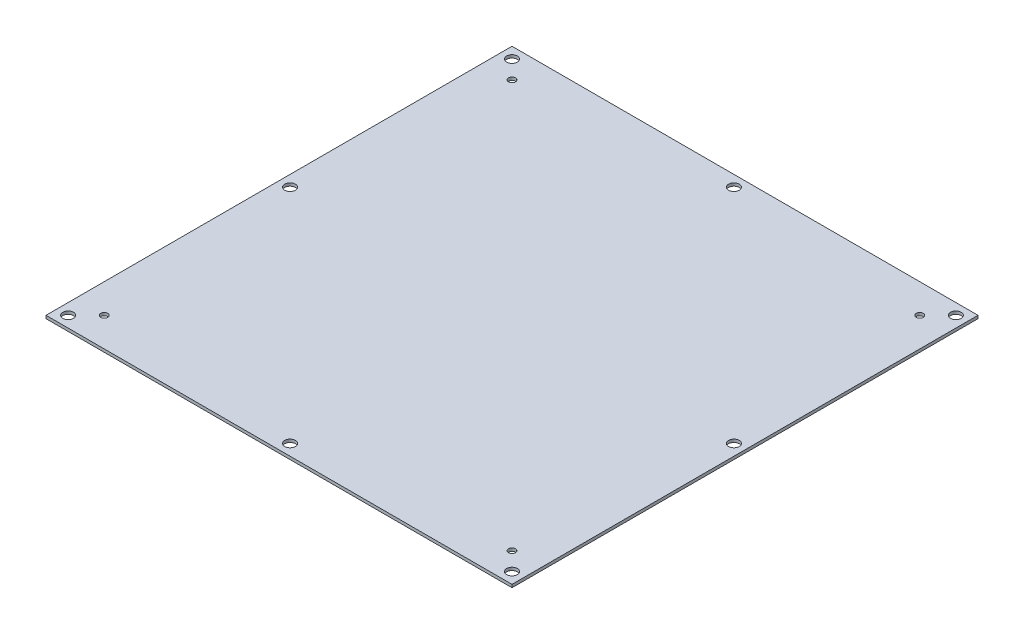
ISO-10303-21;
HEADER;
FILE_DESCRIPTION(('STEP AP214'),'2;1');
FILE_NAME('part.step','',(''),(''),'','','');
FILE_SCHEMA(('AUTOMOTIVE_DESIGN { 1 0 10303 214 1 1 1 1 }'));
ENDSEC;
DATA;
#1=APPLICATION_CONTEXT('core data for automotive mechanical design processes');
#2=APPLICATION_PROTOCOL_DEFINITION('international standard','automotive_design',2000,#1);
#3=PRODUCT_CONTEXT('',#1,'mechanical');
#4=PRODUCT('Part','Part','',(#3));
#5=PRODUCT_RELATED_PRODUCT_CATEGORY('part','',(#4));
#6=PRODUCT_DEFINITION_FORMATION('','',#4);
#7=PRODUCT_DEFINITION_CONTEXT('part definition',#1,'design');
#8=PRODUCT_DEFINITION('design','',#6,#7);
#9=PRODUCT_DEFINITION_SHAPE('','',#8);
#10=(LENGTH_UNIT() NAMED_UNIT(*) SI_UNIT(.MILLI.,.METRE.));
#11=(NAMED_UNIT(*) PLANE_ANGLE_UNIT() SI_UNIT($,.RADIAN.));
#12=(NAMED_UNIT(*) SI_UNIT($,.STERADIAN.) SOLID_ANGLE_UNIT());
#13=UNCERTAINTY_MEASURE_WITH_UNIT(LENGTH_MEASURE(1.E-05),#10,'distance_accuracy_value','');
#14=(GEOMETRIC_REPRESENTATION_CONTEXT(3) GLOBAL_UNCERTAINTY_ASSIGNED_CONTEXT((#13)) GLOBAL_UNIT_ASSIGNED_CONTEXT((#10,
#11,#12)) REPRESENTATION_CONTEXT('',''));
#15=CARTESIAN_POINT('',(0.,0.,0.));
#16=DIRECTION('',(0.,0.,1.));
#17=DIRECTION('',(1.,0.,0.));
#18=AXIS2_PLACEMENT_3D('',#15,#16,#17);
#19=CARTESIAN_POINT('',(0.,0.,0.));
#20=DIRECTION('',(0.,-1.,0.));
#21=DIRECTION('',(0.,0.,-1.));
#22=AXIS2_PLACEMENT_3D('',#19,#20,#21);
#23=PLANE('',#22);
#24=CARTESIAN_POINT('',(-114.3,0.,-114.3));
#25=DIRECTION('',(0.,1.,0.));
#26=DIRECTION('',(0.,0.,1.));
#27=AXIS2_PLACEMENT_3D('',#24,#25,#26);
#28=CIRCLE('',#27,2.75);
#29=CARTESIAN_POINT('',(-114.3,0.,-111.55));
#30=VERTEX_POINT('',#29);
#31=EDGE_CURVE('E475',#30,#30,#28,.T.);
#32=ORIENTED_EDGE('',*,*,#31,.F.);
#33=EDGE_LOOP('',(#32));
#34=FACE_BOUND('',#33,.T.);
#35=CARTESIAN_POINT('',(114.3,0.,-114.3));
#36=DIRECTION('',(0.,1.,0.));
#37=DIRECTION('',(0.,0.,1.));
#38=AXIS2_PLACEMENT_3D('',#35,#36,#37);
#39=CIRCLE('',#38,2.75);
#40=CARTESIAN_POINT('',(114.3,0.,-111.55));
#41=VERTEX_POINT('',#40);
#42=EDGE_CURVE('E270',#41,#41,#39,.T.);
#43=ORIENTED_EDGE('',*,*,#42,.F.);
#44=EDGE_LOOP('',(#43));
#45=FACE_BOUND('',#44,.T.);
#46=CARTESIAN_POINT('',(-114.3,0.,114.3));
#47=DIRECTION('',(0.,1.,0.));
#48=DIRECTION('',(0.,0.,1.));
#49=AXIS2_PLACEMENT_3D('',#46,#47,#48);
#50=CIRCLE('',#49,2.75);
#51=CARTESIAN_POINT('',(-114.3,0.,117.05));
#52=VERTEX_POINT('',#51);
#53=EDGE_CURVE('E267',#52,#52,#50,.T.);
#54=ORIENTED_EDGE('',*,*,#53,.F.);
#55=EDGE_LOOP('',(#54));
#56=FACE_BOUND('',#55,.T.);
#57=CARTESIAN_POINT('',(114.3,0.,0.));
#58=DIRECTION('',(0.,1.,0.));
#59=DIRECTION('',(0.,0.,1.));
#60=AXIS2_PLACEMENT_3D('',#57,#58,#59);
#61=CIRCLE('',#60,2.75);
#62=CARTESIAN_POINT('',(114.3,0.,2.75000000000003));
#63=VERTEX_POINT('',#62);
#64=EDGE_CURVE('E287',#63,#63,#61,.T.);
#65=ORIENTED_EDGE('',*,*,#64,.F.);
#66=EDGE_LOOP('',(#65));
#67=FACE_BOUND('',#66,.T.);
#68=CARTESIAN_POINT('',(0.,0.,114.3));
#69=DIRECTION('',(0.,1.,0.));
#70=DIRECTION('',(0.,0.,1.));
#71=AXIS2_PLACEMENT_3D('',#68,#69,#70);
#72=CIRCLE('',#71,2.75);
#73=CARTESIAN_POINT('',(0.,0.,117.05));
#74=VERTEX_POINT('',#73);
#75=EDGE_CURVE('E212',#74,#74,#72,.T.);
#76=ORIENTED_EDGE('',*,*,#75,.F.);
#77=EDGE_LOOP('',(#76));
#78=FACE_BOUND('',#77,.T.);
#79=CARTESIAN_POINT('',(-105.,0.,-105.));
#80=DIRECTION('',(0.,1.,0.));
#81=DIRECTION('',(0.,0.,1.));
#82=AXIS2_PLACEMENT_3D('',#79,#80,#81);
#83=CIRCLE('',#82,1.79999999999998);
#84=CARTESIAN_POINT('',(-105.,0.,-103.2));
#85=VERTEX_POINT('',#84);
#86=EDGE_CURVE('E224',#85,#85,#83,.T.);
#87=ORIENTED_EDGE('',*,*,#86,.F.);
#88=EDGE_LOOP('',(#87));
#89=FACE_BOUND('',#88,.T.);
#90=CARTESIAN_POINT('',(105.,0.,-105.));
#91=DIRECTION('',(0.,1.,0.));
#92=DIRECTION('',(0.,0.,1.));
#93=AXIS2_PLACEMENT_3D('',#90,#91,#92);
#94=CIRCLE('',#93,1.79999999999998);
#95=CARTESIAN_POINT('',(105.,0.,-103.2));
#96=VERTEX_POINT('',#95);
#97=EDGE_CURVE('E230',#96,#96,#94,.T.);
#98=ORIENTED_EDGE('',*,*,#97,.F.);
#99=EDGE_LOOP('',(#98));
#100=FACE_BOUND('',#99,.T.);
#101=CARTESIAN_POINT('',(105.,0.,105.));
#102=DIRECTION('',(0.,1.,0.));
#103=DIRECTION('',(0.,0.,1.));
#104=AXIS2_PLACEMENT_3D('',#101,#102,#103);
#105=CIRCLE('',#104,1.79999999999998);
#106=CARTESIAN_POINT('',(105.,0.,106.8));
#107=VERTEX_POINT('',#106);
#108=EDGE_CURVE('E236',#107,#107,#105,.T.);
#109=ORIENTED_EDGE('',*,*,#108,.F.);
#110=EDGE_LOOP('',(#109));
#111=FACE_BOUND('',#110,.T.);
#112=CARTESIAN_POINT('',(-105.,0.,105.));
#113=DIRECTION('',(0.,1.,0.));
#114=DIRECTION('',(0.,0.,1.));
#115=AXIS2_PLACEMENT_3D('',#112,#113,#114);
#116=CIRCLE('',#115,1.79999999999998);
#117=CARTESIAN_POINT('',(-105.,0.,106.8));
#118=VERTEX_POINT('',#117);
#119=EDGE_CURVE('E156',#118,#118,#116,.T.);
#120=ORIENTED_EDGE('',*,*,#119,.F.);
#121=EDGE_LOOP('',(#120));
#122=FACE_BOUND('',#121,.T.);
#123=DIRECTION('',(1.,0.,0.));
#124=VECTOR('',#123,1.);
#125=CARTESIAN_POINT('',(0.,0.,-120.));
#126=LINE('',#125,#124);
#127=CARTESIAN_POINT('',(-120.,0.,-120.));
#128=VERTEX_POINT('',#127);
#129=CARTESIAN_POINT('',(120.,0.,-120.));
#130=VERTEX_POINT('',#129);
#131=EDGE_CURVE('E220',#128,#130,#126,.T.);
#132=ORIENTED_EDGE('',*,*,#131,.F.);
#133=DIRECTION('',(0.,0.,-1.));
#134=VECTOR('',#133,1.);
#135=CARTESIAN_POINT('',(-120.,0.,0.));
#136=LINE('',#135,#134);
#137=CARTESIAN_POINT('',(-120.,0.,120.));
#138=VERTEX_POINT('',#137);
#139=EDGE_CURVE('E203',#138,#128,#136,.T.);
#140=ORIENTED_EDGE('',*,*,#139,.F.);
#141=DIRECTION('',(1.,0.,0.));
#142=VECTOR('',#141,1.);
#143=CARTESIAN_POINT('',(0.,0.,120.));
#144=LINE('',#143,#142);
#145=CARTESIAN_POINT('',(120.,0.,120.));
#146=VERTEX_POINT('',#145);
#147=EDGE_CURVE('E168',#138,#146,#144,.T.);
#148=ORIENTED_EDGE('',*,*,#147,.T.);
#149=DIRECTION('',(0.,0.,-1.));
#150=VECTOR('',#149,1.);
#151=CARTESIAN_POINT('',(120.,0.,0.));
#152=LINE('',#151,#150);
#153=EDGE_CURVE('E202',#146,#130,#152,.T.);
#154=ORIENTED_EDGE('',*,*,#153,.T.);
#155=EDGE_LOOP('',(#132,#140,#148,#154));
#156=FACE_BOUND('',#155,.T.);
#157=CARTESIAN_POINT('',(0.,0.,-114.3));
#158=DIRECTION('',(0.,1.,0.));
#159=DIRECTION('',(0.,0.,1.));
#160=AXIS2_PLACEMENT_3D('',#157,#158,#159);
#161=CIRCLE('',#160,2.75);
#162=CARTESIAN_POINT('',(0.,0.,-111.55));
#163=VERTEX_POINT('',#162);
#164=EDGE_CURVE('E254',#163,#163,#161,.T.);
#165=ORIENTED_EDGE('',*,*,#164,.F.);
#166=EDGE_LOOP('',(#165));
#167=FACE_BOUND('',#166,.T.);
#168=CARTESIAN_POINT('',(-114.3,0.,0.));
#169=DIRECTION('',(0.,1.,0.));
#170=DIRECTION('',(0.,0.,1.));
#171=AXIS2_PLACEMENT_3D('',#168,#169,#170);
#172=CIRCLE('',#171,2.75);
#173=CARTESIAN_POINT('',(-114.3,0.,2.74999999999999));
#174=VERTEX_POINT('',#173);
#175=EDGE_CURVE('E258',#174,#174,#172,.T.);
#176=ORIENTED_EDGE('',*,*,#175,.F.);
#177=EDGE_LOOP('',(#176));
#178=FACE_BOUND('',#177,.T.);
#179=CARTESIAN_POINT('',(114.3,0.,114.3));
#180=DIRECTION('',(0.,1.,0.));
#181=DIRECTION('',(0.,0.,1.));
#182=AXIS2_PLACEMENT_3D('',#179,#180,#181);
#183=CIRCLE('',#182,2.75);
#184=CARTESIAN_POINT('',(114.3,0.,117.05));
#185=VERTEX_POINT('',#184);
#186=EDGE_CURVE('E261',#185,#185,#183,.T.);
#187=ORIENTED_EDGE('',*,*,#186,.F.);
#188=EDGE_LOOP('',(#187));
#189=FACE_BOUND('',#188,.T.);
#190=ADVANCED_FACE('F149',(#34,#45,#56,#67,#78,#89,#100,#111,#122,#156,#167,#178,#189),#23,.F.);
#191=CARTESIAN_POINT('',(0.,-1.51892,0.));
#192=DIRECTION('',(0.,-1.,0.));
#193=DIRECTION('',(0.,0.,-1.));
#194=AXIS2_PLACEMENT_3D('',#191,#192,#193);
#195=PLANE('',#194);
#196=CARTESIAN_POINT('',(-114.3,-1.51892,-114.3));
#197=DIRECTION('',(0.,-1.,0.));
#198=DIRECTION('',(0.,0.,-1.));
#199=AXIS2_PLACEMENT_3D('',#196,#197,#198);
#200=CIRCLE('',#199,2.75);
#201=CARTESIAN_POINT('',(-114.3,-1.51892,-117.05));
#202=VERTEX_POINT('',#201);
#203=EDGE_CURVE('E331',#202,#202,#200,.T.);
#204=ORIENTED_EDGE('',*,*,#203,.F.);
#205=EDGE_LOOP('',(#204));
#206=FACE_BOUND('',#205,.T.);
#207=CARTESIAN_POINT('',(114.3,-1.51892,-114.3));
#208=DIRECTION('',(0.,-1.,0.));
#209=DIRECTION('',(0.,0.,-1.));
#210=AXIS2_PLACEMENT_3D('',#207,#208,#209);
#211=CIRCLE('',#210,2.75);
#212=CARTESIAN_POINT('',(114.3,-1.51892,-117.05));
#213=VERTEX_POINT('',#212);
#214=EDGE_CURVE('E264',#213,#213,#211,.T.);
#215=ORIENTED_EDGE('',*,*,#214,.F.);
#216=EDGE_LOOP('',(#215));
#217=FACE_BOUND('',#216,.T.);
#218=CARTESIAN_POINT('',(114.3,-1.51892,114.3));
#219=DIRECTION('',(0.,-1.,0.));
#220=DIRECTION('',(0.,0.,-1.));
#221=AXIS2_PLACEMENT_3D('',#218,#219,#220);
#222=CIRCLE('',#221,2.75);
#223=CARTESIAN_POINT('',(114.3,-1.51892,111.55));
#224=VERTEX_POINT('',#223);
#225=EDGE_CURVE('E263',#224,#224,#222,.T.);
#226=ORIENTED_EDGE('',*,*,#225,.F.);
#227=EDGE_LOOP('',(#226));
#228=FACE_BOUND('',#227,.T.);
#229=CARTESIAN_POINT('',(-114.3,-1.51892,114.3));
#230=DIRECTION('',(0.,-1.,0.));
#231=DIRECTION('',(0.,0.,-1.));
#232=AXIS2_PLACEMENT_3D('',#229,#230,#231);
#233=CIRCLE('',#232,2.75);
#234=CARTESIAN_POINT('',(-114.3,-1.51892,111.55));
#235=VERTEX_POINT('',#234);
#236=EDGE_CURVE('E276',#235,#235,#233,.T.);
#237=ORIENTED_EDGE('',*,*,#236,.F.);
#238=EDGE_LOOP('',(#237));
#239=FACE_BOUND('',#238,.T.);
#240=CARTESIAN_POINT('',(-114.3,-1.51892,0.));
#241=DIRECTION('',(0.,-1.,0.));
#242=DIRECTION('',(0.,0.,-1.));
#243=AXIS2_PLACEMENT_3D('',#240,#241,#242);
#244=CIRCLE('',#243,2.75);
#245=CARTESIAN_POINT('',(-114.3,-1.51892,-2.75000000000002));
#246=VERTEX_POINT('',#245);
#247=EDGE_CURVE('E280',#246,#246,#244,.T.);
#248=ORIENTED_EDGE('',*,*,#247,.F.);
#249=EDGE_LOOP('',(#248));
#250=FACE_BOUND('',#249,.T.);
#251=CARTESIAN_POINT('',(0.,-1.51892,-114.3));
#252=DIRECTION('',(0.,-1.,0.));
#253=DIRECTION('',(0.,0.,-1.));
#254=AXIS2_PLACEMENT_3D('',#251,#252,#253);
#255=CIRCLE('',#254,2.75);
#256=CARTESIAN_POINT('',(0.,-1.51892,-117.05));
#257=VERTEX_POINT('',#256);
#258=EDGE_CURVE('E284',#257,#257,#255,.T.);
#259=ORIENTED_EDGE('',*,*,#258,.F.);
#260=EDGE_LOOP('',(#259));
#261=FACE_BOUND('',#260,.T.);
#262=CARTESIAN_POINT('',(114.3,-1.51892,0.));
#263=DIRECTION('',(0.,-1.,0.));
#264=DIRECTION('',(0.,0.,-1.));
#265=AXIS2_PLACEMENT_3D('',#262,#263,#264);
#266=CIRCLE('',#265,2.75);
#267=CARTESIAN_POINT('',(114.3,-1.51892,-2.74999999999997));
#268=VERTEX_POINT('',#267);
#269=EDGE_CURVE('E290',#268,#268,#266,.T.);
#270=ORIENTED_EDGE('',*,*,#269,.F.);
#271=EDGE_LOOP('',(#270));
#272=FACE_BOUND('',#271,.T.);
#273=CARTESIAN_POINT('',(0.,-1.51892,114.3));
#274=DIRECTION('',(0.,-1.,0.));
#275=DIRECTION('',(0.,0.,-1.));
#276=AXIS2_PLACEMENT_3D('',#273,#274,#275);
#277=CIRCLE('',#276,2.75);
#278=CARTESIAN_POINT('',(0.,-1.51892,111.55));
#279=VERTEX_POINT('',#278);
#280=EDGE_CURVE('E207',#279,#279,#277,.T.);
#281=ORIENTED_EDGE('',*,*,#280,.F.);
#282=EDGE_LOOP('',(#281));
#283=FACE_BOUND('',#282,.T.);
#284=CARTESIAN_POINT('',(-105.,-1.51892,-105.));
#285=DIRECTION('',(0.,1.,0.));
#286=DIRECTION('',(0.,0.,1.));
#287=AXIS2_PLACEMENT_3D('',#284,#285,#286);
#288=CIRCLE('',#287,1.8);
#289=CARTESIAN_POINT('',(-105.,-1.51892,-103.2));
#290=VERTEX_POINT('',#289);
#291=EDGE_CURVE('E227',#290,#290,#288,.T.);
#292=ORIENTED_EDGE('',*,*,#291,.T.);
#293=EDGE_LOOP('',(#292));
#294=FACE_BOUND('',#293,.T.);
#295=CARTESIAN_POINT('',(105.,-1.51892,-105.));
#296=DIRECTION('',(0.,1.,0.));
#297=DIRECTION('',(0.,0.,1.));
#298=AXIS2_PLACEMENT_3D('',#295,#296,#297);
#299=CIRCLE('',#298,1.8);
#300=CARTESIAN_POINT('',(105.,-1.51892,-103.2));
#301=VERTEX_POINT('',#300);
#302=EDGE_CURVE('E233',#301,#301,#299,.T.);
#303=ORIENTED_EDGE('',*,*,#302,.T.);
#304=EDGE_LOOP('',(#303));
#305=FACE_BOUND('',#304,.T.);
#306=CARTESIAN_POINT('',(105.,-1.51892,105.));
#307=DIRECTION('',(0.,1.,0.));
#308=DIRECTION('',(0.,0.,1.));
#309=AXIS2_PLACEMENT_3D('',#306,#307,#308);
#310=CIRCLE('',#309,1.8);
#311=CARTESIAN_POINT('',(105.,-1.51892,106.8));
#312=VERTEX_POINT('',#311);
#313=EDGE_CURVE('E239',#312,#312,#310,.T.);
#314=ORIENTED_EDGE('',*,*,#313,.T.);
#315=EDGE_LOOP('',(#314));
#316=FACE_BOUND('',#315,.T.);
#317=CARTESIAN_POINT('',(-105.,-1.51892,105.));
#318=DIRECTION('',(0.,1.,0.));
#319=DIRECTION('',(0.,0.,1.));
#320=AXIS2_PLACEMENT_3D('',#317,#318,#319);
#321=CIRCLE('',#320,1.8);
#322=CARTESIAN_POINT('',(-105.,-1.51892,106.8));
#323=VERTEX_POINT('',#322);
#324=EDGE_CURVE('E13',#323,#323,#321,.T.);
#325=ORIENTED_EDGE('',*,*,#324,.T.);
#326=EDGE_LOOP('',(#325));
#327=FACE_BOUND('',#326,.T.);
#328=DIRECTION('',(0.,0.,-1.));
#329=VECTOR('',#328,1.);
#330=CARTESIAN_POINT('',(-120.,-1.51892,0.));
#331=LINE('',#330,#329);
#332=CARTESIAN_POINT('',(-120.,-1.51892,120.));
#333=VERTEX_POINT('',#332);
#334=CARTESIAN_POINT('',(-120.,-1.51892,-120.));
#335=VERTEX_POINT('',#334);
#336=EDGE_CURVE('E188',#333,#335,#331,.T.);
#337=ORIENTED_EDGE('',*,*,#336,.T.);
#338=DIRECTION('',(1.,0.,0.));
#339=VECTOR('',#338,1.);
#340=CARTESIAN_POINT('',(0.,-1.51892,-120.));
#341=LINE('',#340,#339);
#342=CARTESIAN_POINT('',(120.,-1.51892,-120.));
#343=VERTEX_POINT('',#342);
#344=EDGE_CURVE('E193',#335,#343,#341,.T.);
#345=ORIENTED_EDGE('',*,*,#344,.T.);
#346=DIRECTION('',(0.,0.,-1.));
#347=VECTOR('',#346,1.);
#348=CARTESIAN_POINT('',(120.,-1.51892,0.));
#349=LINE('',#348,#347);
#350=CARTESIAN_POINT('',(120.,-1.51892,120.));
#351=VERTEX_POINT('',#350);
#352=EDGE_CURVE('E191',#351,#343,#349,.T.);
#353=ORIENTED_EDGE('',*,*,#352,.F.);
#354=DIRECTION('',(1.,0.,0.));
#355=VECTOR('',#354,1.);
#356=CARTESIAN_POINT('',(0.,-1.51892,120.));
#357=LINE('',#356,#355);
#358=EDGE_CURVE('E163',#333,#351,#357,.T.);
#359=ORIENTED_EDGE('',*,*,#358,.F.);
#360=EDGE_LOOP('',(#337,#345,#353,#359));
#361=FACE_BOUND('',#360,.T.);
#362=ADVANCED_FACE('F187',(#206,#217,#228,#239,#250,#261,#272,#283,#294,#305,#316,#327,#361),
#195,.T.);
#363=CARTESIAN_POINT('',(-105.,0.,105.));
#364=DIRECTION('',(0.,1.,0.));
#365=DIRECTION('',(0.,0.,1.));
#366=AXIS2_PLACEMENT_3D('',#363,#364,#365);
#367=CYLINDRICAL_SURFACE('',#366,1.79999999999999);
#368=ORIENTED_EDGE('',*,*,#324,.F.);
#369=EDGE_LOOP('',(#368));
#370=FACE_BOUND('',#369,.T.);
#371=ORIENTED_EDGE('',*,*,#119,.T.);
#372=EDGE_LOOP('',(#371));
#373=FACE_BOUND('',#372,.T.);
#374=ADVANCED_FACE('F244',(#370,#373),#367,.F.);
#375=CARTESIAN_POINT('',(105.,0.,105.));
#376=DIRECTION('',(0.,1.,0.));
#377=DIRECTION('',(0.,0.,1.));
#378=AXIS2_PLACEMENT_3D('',#375,#376,#377);
#379=CYLINDRICAL_SURFACE('',#378,1.79999999999999);
#380=ORIENTED_EDGE('',*,*,#313,.F.);
#381=EDGE_LOOP('',(#380));
#382=FACE_BOUND('',#381,.T.);
#383=ORIENTED_EDGE('',*,*,#108,.T.);
#384=EDGE_LOOP('',(#383));
#385=FACE_BOUND('',#384,.T.);
#386=ADVANCED_FACE('F317',(#382,#385),#379,.F.);
#387=CARTESIAN_POINT('',(105.,0.,-105.));
#388=DIRECTION('',(0.,1.,0.));
#389=DIRECTION('',(0.,0.,1.));
#390=AXIS2_PLACEMENT_3D('',#387,#388,#389);
#391=CYLINDRICAL_SURFACE('',#390,1.79999999999999);
#392=ORIENTED_EDGE('',*,*,#302,.F.);
#393=EDGE_LOOP('',(#392));
#394=FACE_BOUND('',#393,.T.);
#395=ORIENTED_EDGE('',*,*,#97,.T.);
#396=EDGE_LOOP('',(#395));
#397=FACE_BOUND('',#396,.T.);
#398=ADVANCED_FACE('F310',(#394,#397),#391,.F.);
#399=CARTESIAN_POINT('',(-105.,0.,-105.));
#400=DIRECTION('',(0.,1.,0.));
#401=DIRECTION('',(0.,0.,1.));
#402=AXIS2_PLACEMENT_3D('',#399,#400,#401);
#403=CYLINDRICAL_SURFACE('',#402,1.79999999999999);
#404=ORIENTED_EDGE('',*,*,#291,.F.);
#405=EDGE_LOOP('',(#404));
#406=FACE_BOUND('',#405,.T.);
#407=ORIENTED_EDGE('',*,*,#86,.T.);
#408=EDGE_LOOP('',(#407));
#409=FACE_BOUND('',#408,.T.);
#410=ADVANCED_FACE('F303',(#406,#409),#403,.F.);
#411=CARTESIAN_POINT('',(0.,0.,-120.));
#412=DIRECTION('',(0.,0.,-1.));
#413=DIRECTION('',(1.,0.,0.));
#414=AXIS2_PLACEMENT_3D('',#411,#412,#413);
#415=PLANE('',#414);
#416=DIRECTION('',(0.,1.,0.));
#417=VECTOR('',#416,1.);
#418=CARTESIAN_POINT('',(120.,-1.51892,-120.));
#419=LINE('',#418,#417);
#420=EDGE_CURVE('E209',#343,#130,#419,.T.);
#421=ORIENTED_EDGE('',*,*,#420,.F.);
#422=ORIENTED_EDGE('',*,*,#344,.F.);
#423=DIRECTION('',(0.,1.,0.));
#424=VECTOR('',#423,1.);
#425=CARTESIAN_POINT('',(-120.,-1.51892,-120.));
#426=LINE('',#425,#424);
#427=EDGE_CURVE('E201',#335,#128,#426,.T.);
#428=ORIENTED_EDGE('',*,*,#427,.T.);
#429=ORIENTED_EDGE('',*,*,#131,.T.);
#430=EDGE_LOOP('',(#421,#422,#428,#429));
#431=FACE_BOUND('',#430,.T.);
#432=ADVANCED_FACE('F301',(#431),#415,.T.);
#433=CARTESIAN_POINT('',(120.,0.,0.));
#434=DIRECTION('',(-1.,0.,0.));
#435=DIRECTION('',(0.,0.,-1.));
#436=AXIS2_PLACEMENT_3D('',#433,#434,#435);
#437=PLANE('',#436);
#438=ORIENTED_EDGE('',*,*,#352,.T.);
#439=ORIENTED_EDGE('',*,*,#420,.T.);
#440=ORIENTED_EDGE('',*,*,#153,.F.);
#441=DIRECTION('',(0.,1.,0.));
#442=VECTOR('',#441,1.);
#443=CARTESIAN_POINT('',(120.,-1.51892,120.));
#444=LINE('',#443,#442);
#445=EDGE_CURVE('E206',#351,#146,#444,.T.);
#446=ORIENTED_EDGE('',*,*,#445,.F.);
#447=EDGE_LOOP('',(#438,#439,#440,#446));
#448=FACE_BOUND('',#447,.T.);
#449=ADVANCED_FACE('F299',(#448),#437,.F.);
#450=CARTESIAN_POINT('',(-120.,0.,0.));
#451=DIRECTION('',(-1.,0.,0.));
#452=DIRECTION('',(0.,0.,-1.));
#453=AXIS2_PLACEMENT_3D('',#450,#451,#452);
#454=PLANE('',#453);
#455=ORIENTED_EDGE('',*,*,#336,.F.);
#456=DIRECTION('',(0.,1.,0.));
#457=VECTOR('',#456,1.);
#458=CARTESIAN_POINT('',(-120.,-1.51892,120.));
#459=LINE('',#458,#457);
#460=EDGE_CURVE('E199',#333,#138,#459,.T.);
#461=ORIENTED_EDGE('',*,*,#460,.T.);
#462=ORIENTED_EDGE('',*,*,#139,.T.);
#463=ORIENTED_EDGE('',*,*,#427,.F.);
#464=EDGE_LOOP('',(#455,#461,#462,#463));
#465=FACE_BOUND('',#464,.T.);
#466=ADVANCED_FACE('F198',(#465),#454,.T.);
#467=CARTESIAN_POINT('',(0.,0.,120.));
#468=DIRECTION('',(0.,0.,-1.));
#469=DIRECTION('',(1.,0.,0.));
#470=AXIS2_PLACEMENT_3D('',#467,#468,#469);
#471=PLANE('',#470);
#472=ORIENTED_EDGE('',*,*,#358,.T.);
#473=ORIENTED_EDGE('',*,*,#445,.T.);
#474=ORIENTED_EDGE('',*,*,#147,.F.);
#475=ORIENTED_EDGE('',*,*,#460,.F.);
#476=EDGE_LOOP('',(#472,#473,#474,#475));
#477=FACE_BOUND('',#476,.T.);
#478=ADVANCED_FACE('F205',(#477),#471,.F.);
#479=CARTESIAN_POINT('',(0.,0.,114.3));
#480=DIRECTION('',(0.,1.,0.));
#481=DIRECTION('',(0.,0.,1.));
#482=AXIS2_PLACEMENT_3D('',#479,#480,#481);
#483=CYLINDRICAL_SURFACE('',#482,2.75);
#484=ORIENTED_EDGE('',*,*,#75,.T.);
#485=EDGE_LOOP('',(#484));
#486=FACE_BOUND('',#485,.T.);
#487=ORIENTED_EDGE('',*,*,#280,.T.);
#488=EDGE_LOOP('',(#487));
#489=FACE_BOUND('',#488,.T.);
#490=ADVANCED_FACE('F363',(#486,#489),#483,.F.);
#491=CARTESIAN_POINT('',(114.3,0.,0.));
#492=DIRECTION('',(0.,1.,0.));
#493=DIRECTION('',(0.,0.,1.));
#494=AXIS2_PLACEMENT_3D('',#491,#492,#493);
#495=CYLINDRICAL_SURFACE('',#494,2.75);
#496=ORIENTED_EDGE('',*,*,#64,.T.);
#497=EDGE_LOOP('',(#496));
#498=FACE_BOUND('',#497,.T.);
#499=ORIENTED_EDGE('',*,*,#269,.T.);
#500=EDGE_LOOP('',(#499));
#501=FACE_BOUND('',#500,.T.);
#502=ADVANCED_FACE('F365',(#498,#501),#495,.F.);
#503=CARTESIAN_POINT('',(0.,0.,-114.3));
#504=DIRECTION('',(0.,1.,0.));
#505=DIRECTION('',(0.,0.,1.));
#506=AXIS2_PLACEMENT_3D('',#503,#504,#505);
#507=CYLINDRICAL_SURFACE('',#506,2.75);
#508=ORIENTED_EDGE('',*,*,#164,.T.);
#509=EDGE_LOOP('',(#508));
#510=FACE_BOUND('',#509,.T.);
#511=ORIENTED_EDGE('',*,*,#258,.T.);
#512=EDGE_LOOP('',(#511));
#513=FACE_BOUND('',#512,.T.);
#514=ADVANCED_FACE('F372',(#510,#513),#507,.F.);
#515=CARTESIAN_POINT('',(-114.3,0.,0.));
#516=DIRECTION('',(0.,1.,0.));
#517=DIRECTION('',(0.,0.,1.));
#518=AXIS2_PLACEMENT_3D('',#515,#516,#517);
#519=CYLINDRICAL_SURFACE('',#518,2.75);
#520=ORIENTED_EDGE('',*,*,#175,.T.);
#521=EDGE_LOOP('',(#520));
#522=FACE_BOUND('',#521,.T.);
#523=ORIENTED_EDGE('',*,*,#247,.T.);
#524=EDGE_LOOP('',(#523));
#525=FACE_BOUND('',#524,.T.);
#526=ADVANCED_FACE('F420',(#522,#525),#519,.F.);
#527=CARTESIAN_POINT('',(-114.3,0.,114.3));
#528=DIRECTION('',(0.,1.,0.));
#529=DIRECTION('',(0.,0.,1.));
#530=AXIS2_PLACEMENT_3D('',#527,#528,#529);
#531=CYLINDRICAL_SURFACE('',#530,2.75);
#532=ORIENTED_EDGE('',*,*,#53,.T.);
#533=EDGE_LOOP('',(#532));
#534=FACE_BOUND('',#533,.T.);
#535=ORIENTED_EDGE('',*,*,#236,.T.);
#536=EDGE_LOOP('',(#535));
#537=FACE_BOUND('',#536,.T.);
#538=ADVANCED_FACE('F429',(#534,#537),#531,.F.);
#539=CARTESIAN_POINT('',(114.3,0.,114.3));
#540=DIRECTION('',(0.,1.,0.));
#541=DIRECTION('',(0.,0.,1.));
#542=AXIS2_PLACEMENT_3D('',#539,#540,#541);
#543=CYLINDRICAL_SURFACE('',#542,2.75);
#544=ORIENTED_EDGE('',*,*,#186,.T.);
#545=EDGE_LOOP('',(#544));
#546=FACE_BOUND('',#545,.T.);
#547=ORIENTED_EDGE('',*,*,#225,.T.);
#548=EDGE_LOOP('',(#547));
#549=FACE_BOUND('',#548,.T.);
#550=ADVANCED_FACE('F439',(#546,#549),#543,.F.);
#551=CARTESIAN_POINT('',(114.3,0.,-114.3));
#552=DIRECTION('',(0.,1.,0.));
#553=DIRECTION('',(0.,0.,1.));
#554=AXIS2_PLACEMENT_3D('',#551,#552,#553);
#555=CYLINDRICAL_SURFACE('',#554,2.75);
#556=ORIENTED_EDGE('',*,*,#42,.T.);
#557=EDGE_LOOP('',(#556));
#558=FACE_BOUND('',#557,.T.);
#559=ORIENTED_EDGE('',*,*,#214,.T.);
#560=EDGE_LOOP('',(#559));
#561=FACE_BOUND('',#560,.T.);
#562=ADVANCED_FACE('F449',(#558,#561),#555,.F.);
#563=CARTESIAN_POINT('',(-114.3,0.,-114.3));
#564=DIRECTION('',(0.,1.,0.));
#565=DIRECTION('',(0.,0.,1.));
#566=AXIS2_PLACEMENT_3D('',#563,#564,#565);
#567=CYLINDRICAL_SURFACE('',#566,2.75);
#568=ORIENTED_EDGE('',*,*,#31,.T.);
#569=EDGE_LOOP('',(#568));
#570=FACE_BOUND('',#569,.T.);
#571=ORIENTED_EDGE('',*,*,#203,.T.);
#572=EDGE_LOOP('',(#571));
#573=FACE_BOUND('',#572,.T.);
#574=ADVANCED_FACE('F458',(#570,#573),#567,.F.);
#575=CLOSED_SHELL('',(#190,#362,#374,#386,#398,#410,#432,#449,#466,#478,#490,#502,#514,#526,
#538,#550,#562,#574));
#576=MANIFOLD_SOLID_BREP('B2',#575);
#577=ADVANCED_BREP_SHAPE_REPRESENTATION('',(#18,#576),#14);
#578=SHAPE_DEFINITION_REPRESENTATION(#9,#577);
ENDSEC;
END-ISO-10303-21;
